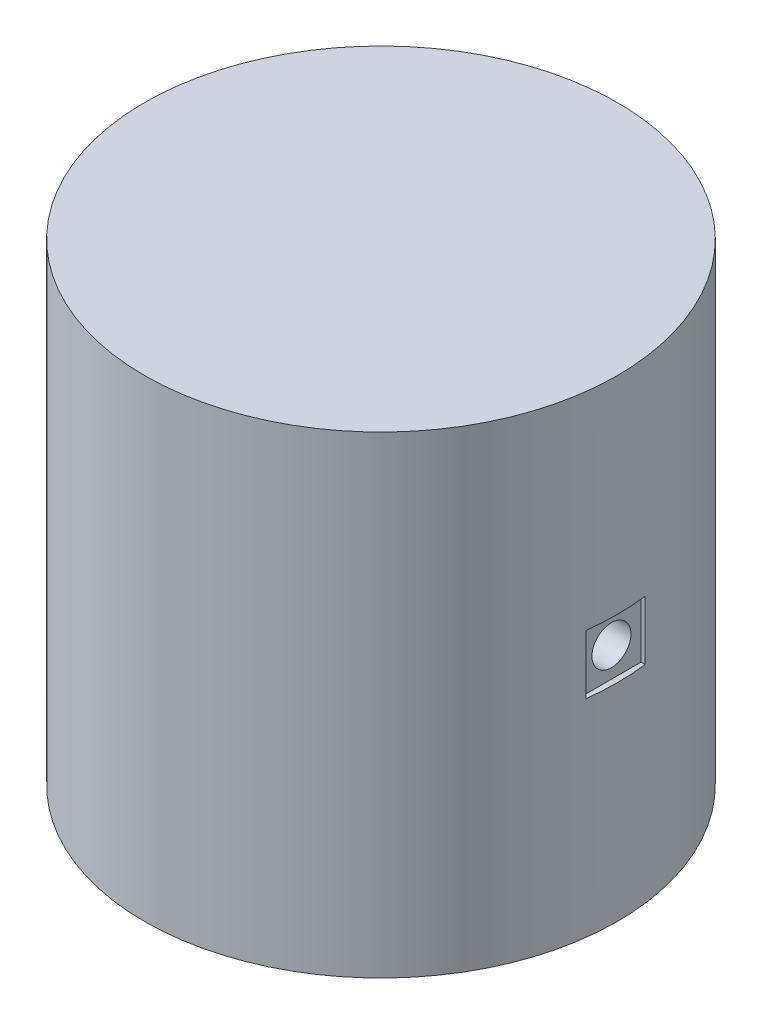
ISO-10303-21;
HEADER;
FILE_DESCRIPTION(('STEP AP214'),'2;1');
FILE_NAME('part.step','',(''),(''),'','','');
FILE_SCHEMA(('AUTOMOTIVE_DESIGN { 1 0 10303 214 1 1 1 1 }'));
ENDSEC;
DATA;
#1=APPLICATION_CONTEXT('core data for automotive mechanical design processes');
#2=APPLICATION_PROTOCOL_DEFINITION('international standard','automotive_design',2000,#1);
#3=PRODUCT_CONTEXT('',#1,'mechanical');
#4=PRODUCT('Part','Part','',(#3));
#5=PRODUCT_RELATED_PRODUCT_CATEGORY('part','',(#4));
#6=PRODUCT_DEFINITION_FORMATION('','',#4);
#7=PRODUCT_DEFINITION_CONTEXT('part definition',#1,'design');
#8=PRODUCT_DEFINITION('design','',#6,#7);
#9=PRODUCT_DEFINITION_SHAPE('','',#8);
#10=(LENGTH_UNIT() NAMED_UNIT(*) SI_UNIT(.MILLI.,.METRE.));
#11=(NAMED_UNIT(*) PLANE_ANGLE_UNIT() SI_UNIT($,.RADIAN.));
#12=(NAMED_UNIT(*) SI_UNIT($,.STERADIAN.) SOLID_ANGLE_UNIT());
#13=UNCERTAINTY_MEASURE_WITH_UNIT(LENGTH_MEASURE(1.E-05),#10,'distance_accuracy_value','');
#14=(GEOMETRIC_REPRESENTATION_CONTEXT(3) GLOBAL_UNCERTAINTY_ASSIGNED_CONTEXT((#13)) GLOBAL_UNIT_ASSIGNED_CONTEXT((#10,
#11,#12)) REPRESENTATION_CONTEXT('',''));
#15=CARTESIAN_POINT('',(0.,0.,0.));
#16=DIRECTION('',(0.,0.,1.));
#17=DIRECTION('',(1.,0.,0.));
#18=AXIS2_PLACEMENT_3D('',#15,#16,#17);
#19=CARTESIAN_POINT('',(0.,40.,0.));
#20=DIRECTION('',(0.,-1.,0.));
#21=DIRECTION('',(0.,0.,-1.));
#22=AXIS2_PLACEMENT_3D('',#19,#20,#21);
#23=CYLINDRICAL_SURFACE('',#22,20.);
#24=DIRECTION('',(0.,-1.,0.));
#25=VECTOR('',#24,1.);
#26=CARTESIAN_POINT('',(19.8431348329844,40.,-2.5));
#27=LINE('',#26,#25);
#28=CARTESIAN_POINT('',(19.8431348329844,22.5,-2.5));
#29=VERTEX_POINT('',#28);
#30=CARTESIAN_POINT('',(19.8431348329844,17.5,-2.5));
#31=VERTEX_POINT('',#30);
#32=EDGE_CURVE('E11',#29,#31,#27,.T.);
#33=ORIENTED_EDGE('',*,*,#32,.T.);
#34=CARTESIAN_POINT('',(0.,17.5,0.));
#35=DIRECTION('',(0.,-1.,0.));
#36=DIRECTION('',(0.,0.,-1.));
#37=AXIS2_PLACEMENT_3D('',#34,#35,#36);
#38=CIRCLE('',#37,20.);
#39=CARTESIAN_POINT('',(19.8431348329844,17.5,2.5));
#40=VERTEX_POINT('',#39);
#41=EDGE_CURVE('E59',#31,#40,#38,.T.);
#42=ORIENTED_EDGE('',*,*,#41,.T.);
#43=DIRECTION('',(0.,-1.,0.));
#44=VECTOR('',#43,1.);
#45=CARTESIAN_POINT('',(19.8431348329844,40.,2.5));
#46=LINE('',#45,#44);
#47=CARTESIAN_POINT('',(19.8431348329844,22.5,2.5));
#48=VERTEX_POINT('',#47);
#49=EDGE_CURVE('E251',#40,#48,#46,.F.);
#50=ORIENTED_EDGE('',*,*,#49,.T.);
#51=CARTESIAN_POINT('',(0.,22.5,0.));
#52=DIRECTION('',(0.,1.,0.));
#53=DIRECTION('',(0.,0.,1.));
#54=AXIS2_PLACEMENT_3D('',#51,#52,#53);
#55=CIRCLE('',#54,20.);
#56=EDGE_CURVE('E46',#48,#29,#55,.T.);
#57=ORIENTED_EDGE('',*,*,#56,.T.);
#58=EDGE_LOOP('',(#33,#42,#50,#57));
#59=FACE_BOUND('',#58,.T.);
#60=CARTESIAN_POINT('',(0.,24.,-20.));
#61=CARTESIAN_POINT('',(-0.222307627170533,23.9999918220066,-19.9999959032348));
#62=CARTESIAN_POINT('',(-0.444718640806089,23.9814046281294,-19.9962554071292));
#63=CARTESIAN_POINT('',(-0.883254030756077,23.907605999539,-19.9816946249293));
#64=CARTESIAN_POINT('',(-1.09937327016542,23.852365468794,-19.9708687144076));
#65=CARTESIAN_POINT('',(-1.51892122105325,23.7070349055168,-19.9433459711314));
#66=CARTESIAN_POINT('',(-1.72236187173253,23.6169782526213,-19.9266547630683));
#67=CARTESIAN_POINT('',(-2.1112319554569,23.4046710099548,-19.889215921413));
#68=CARTESIAN_POINT('',(-2.29666246030325,23.2824223375711,-19.8684685294298));
#69=CARTESIAN_POINT('',(-2.64677390925945,23.0074460228343,-19.8248866131972));
#70=CARTESIAN_POINT('',(-2.81117580463408,22.8543665784353,-19.8020298201681));
#71=CARTESIAN_POINT('',(-3.11214702643213,22.5228303344331,-19.7569672181094));
#72=CARTESIAN_POINT('',(-3.24871417908175,22.344371554659,-19.7347614600387));
#73=CARTESIAN_POINT('',(-3.49132701339042,21.965135227953,-19.6932976724827));
#74=CARTESIAN_POINT('',(-3.59708375546325,21.7641694248164,-19.6740682945156));
#75=CARTESIAN_POINT('',(-3.77322266632145,21.3468727239819,-19.6410507224189));
#76=CARTESIAN_POINT('',(-3.84360832974976,21.1305433466079,-19.6272619907853));
#77=CARTESIAN_POINT('',(-3.94610119953993,20.6916625443689,-19.6069122097851));
#78=CARTESIAN_POINT('',(-3.97869799183396,20.4692298234434,-19.6002588031638));
#79=CARTESIAN_POINT('',(-4.00620851090316,20.0219607145582,-19.5946550013038));
#80=CARTESIAN_POINT('',(-4.00112609085425,19.7971245747265,-19.5957038184152));
#81=CARTESIAN_POINT('',(-3.9538182924077,19.3550128479153,-19.6053020462212));
#82=CARTESIAN_POINT('',(-3.91215416097573,19.1376743774906,-19.6137381144293));
#83=CARTESIAN_POINT('',(-3.79375153849209,18.7131356933482,-19.6369818463213));
#84=CARTESIAN_POINT('',(-3.71701137240269,18.505935964324,-19.65178981429));
#85=CARTESIAN_POINT('',(-3.53009913469891,18.1059389531856,-19.6862247400376));
#86=CARTESIAN_POINT('',(-3.41970460492847,17.9132484817233,-19.7058835925539));
#87=CARTESIAN_POINT('',(-3.16877429829071,17.5489166001088,-19.7477847509168));
#88=CARTESIAN_POINT('',(-3.02823505742732,17.3772776125954,-19.7700273535331));
#89=CARTESIAN_POINT('',(-2.71799973824234,17.0566823901723,-19.81508084966));
#90=CARTESIAN_POINT('',(-2.54782464484978,16.9081897285635,-19.8378947684366));
#91=CARTESIAN_POINT('',(-2.18474009624804,16.6417846147951,-19.8811539485759));
#92=CARTESIAN_POINT('',(-1.99183034951756,16.5238725548257,-19.9015991795588));
#93=CARTESIAN_POINT('',(-1.58823754751569,16.3218899630961,-19.9378676064356));
#94=CARTESIAN_POINT('',(-1.3775272783412,16.2378724254219,-19.9536835539309));
#95=CARTESIAN_POINT('',(-0.944595905794662,16.1065581038457,-19.9788563595143));
#96=CARTESIAN_POINT('',(-0.722376200289802,16.0592568717055,-19.9882140000212));
#97=CARTESIAN_POINT('',(-0.276717622508605,16.0033741848229,-19.9993068746747));
#98=CARTESIAN_POINT('',(-0.053361313302308,15.9941583218389,-20.0011669860988));
#99=CARTESIAN_POINT('',(0.391699736770853,16.0129994357687,-19.9974020772041));
#100=CARTESIAN_POINT('',(0.61340456977517,16.0410543174104,-19.9917774776578));
#101=CARTESIAN_POINT('',(1.04682263978616,16.1331134941758,-19.9737532803207));
#102=CARTESIAN_POINT('',(1.25860779335961,16.1967922739916,-19.9614150561683));
#103=CARTESIAN_POINT('',(1.66849450999867,16.3579359306232,-19.9313420824413));
#104=CARTESIAN_POINT('',(1.86659504655016,16.4554033387073,-19.9136069285691));
#105=CARTESIAN_POINT('',(2.24616469474487,16.6827299626053,-19.8743964613318));
#106=CARTESIAN_POINT('',(2.42740050700875,16.8129711241558,-19.8528780174821));
#107=CARTESIAN_POINT('',(2.76567207647682,17.1016367648291,-19.8085893931953));
#108=CARTESIAN_POINT('',(2.92270523572305,17.2600642655995,-19.7858190787355));
#109=CARTESIAN_POINT('',(3.2105623630967,17.6034934075645,-19.7411721422786));
#110=CARTESIAN_POINT('',(3.34095080979462,17.7888629768853,-19.7193144093322));
#111=CARTESIAN_POINT('',(3.56874168020482,18.1792454454267,-19.6793676718478));
#112=CARTESIAN_POINT('',(3.66614542369161,18.3842575582942,-19.6612785165337));
#113=CARTESIAN_POINT('',(3.82460736632784,18.8070729845982,-19.6310696233753));
#114=CARTESIAN_POINT('',(3.8858539991642,19.0248033648413,-19.6189189948875));
#115=CARTESIAN_POINT('',(3.97083460650878,19.4677338139636,-19.601897471681));
#116=CARTESIAN_POINT('',(3.99457347290045,19.6929329048374,-19.5970256276445));
#117=CARTESIAN_POINT('',(4.00368364346987,20.1400354581773,-19.5951659852552));
#118=CARTESIAN_POINT('',(3.98974315228358,20.361924595708,-19.598036767572));
#119=CARTESIAN_POINT('',(3.92540921640024,20.8001265996201,-19.6110229393846));
#120=CARTESIAN_POINT('',(3.87501606451719,21.0164395107792,-19.6211382706868));
#121=CARTESIAN_POINT('',(3.73951427399582,21.4369108449622,-19.6474105687663));
#122=CARTESIAN_POINT('',(3.65449002686938,21.6410974420097,-19.6635528407532));
#123=CARTESIAN_POINT('',(3.45221857840642,22.0324148829378,-19.7000685989668));
#124=CARTESIAN_POINT('',(3.33496867509953,22.2195442949005,-19.7204424399558));
#125=CARTESIAN_POINT('',(3.06922365914566,22.5748622886013,-19.763558420929));
#126=CARTESIAN_POINT('',(2.92023154894072,22.7426750610704,-19.786334916388));
#127=CARTESIAN_POINT('',(2.59625747605256,23.0511448221167,-19.8314432748782));
#128=CARTESIAN_POINT('',(2.42126954861334,23.1917955612691,-19.8537750345274));
#129=CARTESIAN_POINT('',(2.04807051635299,23.4433385757858,-19.8957532955189));
#130=CARTESIAN_POINT('',(1.84963553771934,23.5539040131201,-19.9153692487698));
#131=CARTESIAN_POINT('',(1.43666544376293,23.7399444903864,-19.9494050034));
#132=CARTESIAN_POINT('',(1.22214504345251,23.81545115813,-19.9638294855446));
#133=CARTESIAN_POINT('',(0.839285955695119,23.9146077921789,-19.9830549038148));
#134=CARTESIAN_POINT('',(0.67312665605514,23.946572774831,-19.9893721263381));
#135=CARTESIAN_POINT('',(0.337998100840269,23.9892716494335,-19.9978461655957));
#136=CARTESIAN_POINT('',(0.169028934994477,24.0000062180391,-20.0000031149262));
#137=CARTESIAN_POINT('',(0.,24.,-20.));
#138=B_SPLINE_CURVE_WITH_KNOTS('',3,(#60,#61,#62,#63,#64,#65,#66,#67,#68,#69,#70,#71,#72,#73,
#74,#75,#76,#77,#78,#79,#80,#81,#82,#83,#84,#85,#86,#87,#88,#89,#90,#91,#92,#93,#94,#95,#96,#97,
#98,#99,#100,#101,#102,#103,#104,#105,#106,#107,#108,#109,#110,#111,#112,#113,#114,#115,#116,
#117,#118,#119,#120,#121,#122,#123,#124,#125,#126,#127,#128,#129,#130,#131,#132,#133,#134,#135,
#136,#137),.UNSPECIFIED.,.T.,.F.,(4,2,2,2,2,2,2,2,2,2,2,2,2,2,2,2,2,2,2,2,2,2,2,2,2,2,2,2,2,2,2,
2,2,2,2,2,2,2,4),(0.,0.666304522645033,1.33313860276529,1.99933494100137,2.66549160892345,
3.33973068044874,4.01402238698946,4.69444780023691,5.3748059746079,6.04624740416218,
6.71762017128681,7.37886908028893,8.04014957018699,8.70589960818151,9.37172619002462,
10.0495300996918,10.7273427016306,11.4062109941988,12.0849970279592,12.7524294270884,
13.4198243063525,14.0812181580667,14.7426615686787,15.4122026413721,16.081815533875,
16.7616251432068,17.4414075489765,18.1176152413467,18.7937347332544,19.4575889027459,
20.1214377397421,20.7836784501622,21.4459747033125,22.1195230496035,22.793226181355,
23.4739798670633,24.1541182207385,24.6607510116336,25.1673676548776),.UNSPECIFIED.);
#139=CARTESIAN_POINT('',(0.,24.,-20.));
#140=VERTEX_POINT('',#139);
#141=EDGE_CURVE('E155',#140,#140,#138,.T.);
#142=ORIENTED_EDGE('',*,*,#141,.T.);
#143=EDGE_LOOP('',(#142));
#144=FACE_BOUND('',#143,.T.);
#145=CARTESIAN_POINT('',(0.,40.,0.));
#146=DIRECTION('',(0.,1.,0.));
#147=DIRECTION('',(0.,0.,1.));
#148=AXIS2_PLACEMENT_3D('',#145,#146,#147);
#149=CIRCLE('',#148,20.);
#150=CARTESIAN_POINT('',(0.,40.,20.));
#151=VERTEX_POINT('',#150);
#152=EDGE_CURVE('E159',#151,#151,#149,.T.);
#153=ORIENTED_EDGE('',*,*,#152,.F.);
#154=EDGE_LOOP('',(#153));
#155=FACE_BOUND('',#154,.T.);
#156=CARTESIAN_POINT('',(0.,0.,0.));
#157=DIRECTION('',(0.,1.,0.));
#158=DIRECTION('',(0.,0.,1.));
#159=AXIS2_PLACEMENT_3D('',#156,#157,#158);
#160=CIRCLE('',#159,20.);
#161=CARTESIAN_POINT('',(0.,0.,20.));
#162=VERTEX_POINT('',#161);
#163=EDGE_CURVE('E162',#162,#162,#160,.T.);
#164=ORIENTED_EDGE('',*,*,#163,.T.);
#165=EDGE_LOOP('',(#164));
#166=FACE_BOUND('',#165,.T.);
#167=ADVANCED_FACE('F38',(#59,#144,#155,#166),#23,.T.);
#168=CARTESIAN_POINT('',(0.,40.,0.));
#169=DIRECTION('',(0.,1.,0.));
#170=DIRECTION('',(0.,0.,1.));
#171=AXIS2_PLACEMENT_3D('',#168,#169,#170);
#172=PLANE('',#171);
#173=ORIENTED_EDGE('',*,*,#152,.T.);
#174=EDGE_LOOP('',(#173));
#175=FACE_BOUND('',#174,.T.);
#176=ADVANCED_FACE('F144',(#175),#172,.T.);
#177=CARTESIAN_POINT('',(0.,0.,0.));
#178=DIRECTION('',(0.,1.,0.));
#179=DIRECTION('',(0.,0.,1.));
#180=AXIS2_PLACEMENT_3D('',#177,#178,#179);
#181=PLANE('',#180);
#182=ORIENTED_EDGE('',*,*,#163,.F.);
#183=EDGE_LOOP('',(#182));
#184=FACE_BOUND('',#183,.T.);
#185=ADVANCED_FACE('F148',(#184),#181,.F.);
#186=CARTESIAN_POINT('',(0.,20.,10.));
#187=DIRECTION('',(0.,0.,-1.));
#188=DIRECTION('',(-1.,0.,0.));
#189=AXIS2_PLACEMENT_3D('',#186,#187,#188);
#190=CYLINDRICAL_SURFACE('',#189,4.);
#191=CARTESIAN_POINT('',(4.,20.,-1.65));
#192=CARTESIAN_POINT('',(3.99999309817074,20.0884596783633,-1.64999078279336));
#193=CARTESIAN_POINT('',(3.99703145792172,20.1770622520576,-1.64284398565668));
#194=CARTESIAN_POINT('',(3.9854711320255,20.3517596698364,-1.6145088580631));
#195=CARTESIAN_POINT('',(3.97685757767606,20.437847271997,-1.59328348897568));
#196=CARTESIAN_POINT('',(3.95491965529936,20.6047024969027,-1.5377051877981));
#197=CARTESIAN_POINT('',(3.94161112398211,20.6854869344912,-1.50339635664654));
#198=CARTESIAN_POINT('',(3.91158286286531,20.8400766332235,-1.42280524215057));
#199=CARTESIAN_POINT('',(3.89486420463244,20.9138840761176,-1.37652671882984));
#200=CARTESIAN_POINT('',(3.85876900012149,21.0561876959853,-1.27089324535595));
#201=CARTESIAN_POINT('',(3.83930654387258,21.1242937395748,-1.21104232975102));
#202=CARTESIAN_POINT('',(3.80029483347099,21.2498357438476,-1.08101116034103));
#203=CARTESIAN_POINT('',(3.78074553976622,21.3072661892696,-1.01082560078819));
#204=CARTESIAN_POINT('',(3.74272551686067,21.4125482680905,-0.858031751128285));
#205=CARTESIAN_POINT('',(3.72435159658093,21.4598078179056,-0.774988884693473));
#206=CARTESIAN_POINT('',(3.69212136090386,21.5395135819941,-0.601263690709815));
#207=CARTESIAN_POINT('',(3.67826276509115,21.5719672771279,-0.510585248636989));
#208=CARTESIAN_POINT('',(3.65756021871623,21.6195373822249,-0.328652002998168));
#209=CARTESIAN_POINT('',(3.65041449103236,21.6354037141715,-0.237628927856928));
#210=CARTESIAN_POINT('',(3.64307714795703,21.651689181208,-0.0539534926347211));
#211=CARTESIAN_POINT('',(3.64288180572738,21.65211659474,0.0386979676293037));
#212=CARTESIAN_POINT('',(3.64921138579605,21.6380778077983,0.215598886618723));
#213=CARTESIAN_POINT('',(3.6552343974104,21.6247239848746,0.299958158749157));
#214=CARTESIAN_POINT('',(3.67247532251837,21.585364842312,0.465110284381171));
#215=CARTESIAN_POINT('',(3.68369420783859,21.5593571558718,0.545902467603298));
#216=CARTESIAN_POINT('',(3.71031458481431,21.4949241294249,0.703645108758621));
#217=CARTESIAN_POINT('',(3.72579923184191,21.4562486697302,0.78047873780833));
#218=CARTESIAN_POINT('',(3.75918616236907,21.3677544544362,0.926860232460034));
#219=CARTESIAN_POINT('',(3.77708938726885,21.3179313547816,0.996405242249149));
#220=CARTESIAN_POINT('',(3.81509742396095,21.2037191192487,1.13228640778781));
#221=CARTESIAN_POINT('',(3.8352618825369,21.1384663009439,1.19788195770326));
#222=CARTESIAN_POINT('',(3.87426910607353,20.9976825548662,1.31744467444138));
#223=CARTESIAN_POINT('',(3.8931115728953,20.9221493198474,1.37140922386084));
#224=CARTESIAN_POINT('',(3.92787932271737,20.7607363697373,1.46723477358504));
#225=CARTESIAN_POINT('',(3.94373050716791,20.6746640940722,1.50880028319417));
#226=CARTESIAN_POINT('',(3.97016319816605,20.495928253553,1.57660302410888));
#227=CARTESIAN_POINT('',(3.98074755693754,20.4032682873724,1.60284855321117));
#228=CARTESIAN_POINT('',(3.99492450637935,20.2201813043177,1.63772950367822));
#229=CARTESIAN_POINT('',(3.99891121146315,20.1299741723082,1.64735917793593));
#230=CARTESIAN_POINT('',(4.00069746426785,19.9491525598478,1.6516920437633));
#231=CARTESIAN_POINT('',(3.99849874371343,19.8585382004994,1.64639941310822));
#232=CARTESIAN_POINT('',(3.98841747083847,19.6840922445124,1.62175473175704));
#233=CARTESIAN_POINT('',(3.9808153168881,19.6001446824733,1.60309592665991));
#234=CARTESIAN_POINT('',(3.96098887803091,19.4366595266704,1.55320790366289));
#235=CARTESIAN_POINT('',(3.94876400644332,19.3571224941279,1.52197709018521));
#236=CARTESIAN_POINT('',(3.92039728883464,19.2019380240355,1.44681062001911));
#237=CARTESIAN_POINT('',(3.90414585630856,19.1264873433395,1.40251143824378));
#238=CARTESIAN_POINT('',(3.86946768187548,18.9838215267909,1.30286606574213));
#239=CARTESIAN_POINT('',(3.85104004134398,18.9166098165789,1.24751530491016));
#240=CARTESIAN_POINT('',(3.8124029584454,18.7873800570726,1.12279569518803));
#241=CARTESIAN_POINT('',(3.79215916493832,18.7260563543818,1.0527161759607));
#242=CARTESIAN_POINT('',(3.7533392894083,18.6158516451749,0.902928709391473));
#243=CARTESIAN_POINT('',(3.73476355904109,18.5669732583727,0.823218740057447));
#244=CARTESIAN_POINT('',(3.70128700339843,18.4825771770861,0.654904629466687));
#245=CARTESIAN_POINT('',(3.68643724424496,18.4472419706347,0.566198083991944));
#246=CARTESIAN_POINT('',(3.66281640168181,18.3923038183461,0.383290834021757));
#247=CARTESIAN_POINT('',(3.65404044124936,18.3726882482525,0.289094603581828));
#248=CARTESIAN_POINT('',(3.64429559365239,18.3509887605973,0.105569726841936));
#249=CARTESIAN_POINT('',(3.64278573581523,18.3476895063588,0.0164127805420622));
#250=CARTESIAN_POINT('',(3.64631178238903,18.3554851464343,-0.161128470759178));
#251=CARTESIAN_POINT('',(3.65134672892697,18.3665779343827,-0.24951288691937));
#252=CARTESIAN_POINT('',(3.666904904187,18.4018288199343,-0.418933071257696));
#253=CARTESIAN_POINT('',(3.67717261200251,18.4253804156255,-0.500120711422108));
#254=CARTESIAN_POINT('',(3.70184411206584,18.4842940052707,-0.657414522474082));
#255=CARTESIAN_POINT('',(3.7162490615217,18.5196593040311,-0.733519264297608));
#256=CARTESIAN_POINT('',(3.7486340889516,18.6036193774621,-0.883422038241396));
#257=CARTESIAN_POINT('',(3.76677577854003,18.6528755640073,-0.956814071021407));
#258=CARTESIAN_POINT('',(3.80412864636709,18.7622828186218,-1.09467168726428));
#259=CARTESIAN_POINT('',(3.82334018195056,18.8224375422704,-1.15913426277442));
#260=CARTESIAN_POINT('',(3.86230172013188,18.9569926124426,-1.28199413870367));
#261=CARTESIAN_POINT('',(3.88199359359226,19.0320998892698,-1.33963922360553));
#262=CARTESIAN_POINT('',(3.91832426905579,19.191656536818,-1.44154015953871));
#263=CARTESIAN_POINT('',(3.9349616732268,19.2761101565571,-1.48578988636589));
#264=CARTESIAN_POINT('',(3.96305691394126,19.4505852398904,-1.55866373983474));
#265=CARTESIAN_POINT('',(3.97459855421812,19.5404866183506,-1.58754242535854));
#266=CARTESIAN_POINT('',(3.99154438775475,19.7242807707868,-1.62951108478514));
#267=CARTESIAN_POINT('',(3.99696786149576,19.818160033182,-1.64265066624544));
#268=CARTESIAN_POINT('',(3.99968194626838,19.9415557047728,-1.64922677033004));
#269=CARTESIAN_POINT('',(4.00000228058838,19.9707700513297,-1.65000304566421));
#270=CARTESIAN_POINT('',(4.,20.,-1.65));
#271=B_SPLINE_CURVE_WITH_KNOTS('',3,(#191,#192,#193,#194,#195,#196,#197,#198,#199,#200,#201,
#202,#203,#204,#205,#206,#207,#208,#209,#210,#211,#212,#213,#214,#215,#216,#217,#218,#219,#220,
#221,#222,#223,#224,#225,#226,#227,#228,#229,#230,#231,#232,#233,#234,#235,#236,#237,#238,#239,
#240,#241,#242,#243,#244,#245,#246,#247,#248,#249,#250,#251,#252,#253,#254,#255,#256,#257,#258,
#259,#260,#261,#262,#263,#264,#265,#266,#267,#268,#269,#270),.UNSPECIFIED.,.T.,.F.,(4,2,2,2,2,2,
2,2,2,2,2,2,2,2,2,2,2,2,2,2,2,2,2,2,2,2,2,2,2,2,2,2,2,2,2,2,2,2,2,4),(0.,0.265297098770622,
0.53129493790666,0.796403981498878,1.06142984766523,1.33841878994457,1.61555043582129,
1.90598404924538,2.19627075414925,2.47277648539421,2.7491339503796,3.00480633611683,
3.2605265616686,3.52163539301341,3.78284615202014,4.06565185095456,4.34852112528509,
4.63767392136375,4.92666995726767,5.19768149557685,5.46861716672805,5.72643264660554,
5.98428085748384,6.25011488704506,6.51605907418432,6.80064580250402,7.08529238632158,
7.37364985225781,7.66177550895676,7.92807823226724,8.19434198489785,8.44869772098559,
8.70312467109945,8.97267479984709,9.24231550885213,9.53104085816542,9.81989801073178,
10.1038095613048,10.3868238858899,10.4744866574818),.UNSPECIFIED.);
#272=CARTESIAN_POINT('',(4.,20.,-1.65));
#273=VERTEX_POINT('',#272);
#274=EDGE_CURVE('E111',#273,#273,#271,.T.);
#275=ORIENTED_EDGE('',*,*,#274,.T.);
#276=EDGE_LOOP('',(#275));
#277=FACE_BOUND('',#276,.T.);
#278=CARTESIAN_POINT('',(0.,20.,10.));
#279=DIRECTION('',(0.,0.,-1.));
#280=DIRECTION('',(-1.,0.,0.));
#281=AXIS2_PLACEMENT_3D('',#278,#279,#280);
#282=CIRCLE('',#281,4.);
#283=CARTESIAN_POINT('',(-4.,20.,10.));
#284=VERTEX_POINT('',#283);
#285=EDGE_CURVE('E119',#284,#284,#282,.T.);
#286=ORIENTED_EDGE('',*,*,#285,.F.);
#287=EDGE_LOOP('',(#286));
#288=FACE_BOUND('',#287,.T.);
#289=ORIENTED_EDGE('',*,*,#141,.F.);
#290=EDGE_LOOP('',(#289));
#291=FACE_BOUND('',#290,.T.);
#292=ADVANCED_FACE('F173',(#277,#288,#291),#190,.F.);
#293=CARTESIAN_POINT('',(0.,20.,10.));
#294=DIRECTION('',(0.,0.,-1.));
#295=DIRECTION('',(-1.,0.,0.));
#296=AXIS2_PLACEMENT_3D('',#293,#294,#295);
#297=PLANE('',#296);
#298=ORIENTED_EDGE('',*,*,#285,.T.);
#299=EDGE_LOOP('',(#298));
#300=FACE_BOUND('',#299,.T.);
#301=ADVANCED_FACE('F127',(#300),#297,.T.);
#302=CARTESIAN_POINT('',(20.,20.,0.));
#303=DIRECTION('',(1.,0.,0.));
#304=DIRECTION('',(0.,0.,-1.));
#305=AXIS2_PLACEMENT_3D('',#302,#303,#304);
#306=CYLINDRICAL_SURFACE('',#305,1.65);
#307=CARTESIAN_POINT('',(19.5,20.,0.));
#308=DIRECTION('',(-1.,0.,0.));
#309=DIRECTION('',(0.,0.,1.));
#310=AXIS2_PLACEMENT_3D('',#307,#308,#309);
#311=CIRCLE('',#310,1.65);
#312=CARTESIAN_POINT('',(19.5,20.,1.65));
#313=VERTEX_POINT('',#312);
#314=EDGE_CURVE('E107',#313,#313,#311,.F.);
#315=ORIENTED_EDGE('',*,*,#314,.T.);
#316=EDGE_LOOP('',(#315));
#317=FACE_BOUND('',#316,.T.);
#318=ORIENTED_EDGE('',*,*,#274,.F.);
#319=EDGE_LOOP('',(#318));
#320=FACE_BOUND('',#319,.T.);
#321=ADVANCED_FACE('F123',(#317,#320),#306,.F.);
#322=CARTESIAN_POINT('',(19.5,17.5,-2.5));
#323=DIRECTION('',(0.,0.,-1.));
#324=DIRECTION('',(-1.,0.,0.));
#325=AXIS2_PLACEMENT_3D('',#322,#323,#324);
#326=PLANE('',#325);
#327=DIRECTION('',(1.,0.,0.));
#328=VECTOR('',#327,1.);
#329=CARTESIAN_POINT('',(19.5,22.5,-2.5));
#330=LINE('',#329,#328);
#331=CARTESIAN_POINT('',(19.5,22.5,-2.5));
#332=VERTEX_POINT('',#331);
#333=EDGE_CURVE('E79',#332,#29,#330,.T.);
#334=ORIENTED_EDGE('',*,*,#333,.F.);
#335=DIRECTION('',(0.,1.,0.));
#336=VECTOR('',#335,1.);
#337=CARTESIAN_POINT('',(19.5,17.5,-2.5));
#338=LINE('',#337,#336);
#339=CARTESIAN_POINT('',(19.5,17.5,-2.5));
#340=VERTEX_POINT('',#339);
#341=EDGE_CURVE('E83',#340,#332,#338,.T.);
#342=ORIENTED_EDGE('',*,*,#341,.F.);
#343=DIRECTION('',(1.,0.,0.));
#344=VECTOR('',#343,1.);
#345=CARTESIAN_POINT('',(19.5,17.5,-2.5));
#346=LINE('',#345,#344);
#347=EDGE_CURVE('E105',#340,#31,#346,.T.);
#348=ORIENTED_EDGE('',*,*,#347,.T.);
#349=ORIENTED_EDGE('',*,*,#32,.F.);
#350=EDGE_LOOP('',(#334,#342,#348,#349));
#351=FACE_BOUND('',#350,.T.);
#352=ADVANCED_FACE('F81',(#351),#326,.F.);
#353=CARTESIAN_POINT('',(19.5,17.5,2.5));
#354=DIRECTION('',(0.,-1.,0.));
#355=DIRECTION('',(0.,0.,-1.));
#356=AXIS2_PLACEMENT_3D('',#353,#354,#355);
#357=PLANE('',#356);
#358=ORIENTED_EDGE('',*,*,#347,.F.);
#359=DIRECTION('',(0.,0.,-1.));
#360=VECTOR('',#359,1.);
#361=CARTESIAN_POINT('',(19.5,17.5,2.5));
#362=LINE('',#361,#360);
#363=CARTESIAN_POINT('',(19.5,17.5,2.5));
#364=VERTEX_POINT('',#363);
#365=EDGE_CURVE('E87',#364,#340,#362,.T.);
#366=ORIENTED_EDGE('',*,*,#365,.F.);
#367=DIRECTION('',(1.,0.,0.));
#368=VECTOR('',#367,1.);
#369=CARTESIAN_POINT('',(19.5,17.5,2.5));
#370=LINE('',#369,#368);
#371=EDGE_CURVE('E108',#364,#40,#370,.T.);
#372=ORIENTED_EDGE('',*,*,#371,.T.);
#373=ORIENTED_EDGE('',*,*,#41,.F.);
#374=EDGE_LOOP('',(#358,#366,#372,#373));
#375=FACE_BOUND('',#374,.T.);
#376=ADVANCED_FACE('F131',(#375),#357,.F.);
#377=CARTESIAN_POINT('',(19.5,17.5,2.5));
#378=DIRECTION('',(0.,0.,1.));
#379=DIRECTION('',(1.,0.,0.));
#380=AXIS2_PLACEMENT_3D('',#377,#378,#379);
#381=PLANE('',#380);
#382=ORIENTED_EDGE('',*,*,#371,.F.);
#383=DIRECTION('',(0.,-1.,0.));
#384=VECTOR('',#383,1.);
#385=CARTESIAN_POINT('',(19.5,17.5,2.5));
#386=LINE('',#385,#384);
#387=CARTESIAN_POINT('',(19.5,22.5,2.5));
#388=VERTEX_POINT('',#387);
#389=EDGE_CURVE('E96',#388,#364,#386,.T.);
#390=ORIENTED_EDGE('',*,*,#389,.F.);
#391=DIRECTION('',(1.,0.,0.));
#392=VECTOR('',#391,1.);
#393=CARTESIAN_POINT('',(19.5,22.5,2.5));
#394=LINE('',#393,#392);
#395=EDGE_CURVE('E86',#388,#48,#394,.T.);
#396=ORIENTED_EDGE('',*,*,#395,.T.);
#397=ORIENTED_EDGE('',*,*,#49,.F.);
#398=EDGE_LOOP('',(#382,#390,#396,#397));
#399=FACE_BOUND('',#398,.T.);
#400=ADVANCED_FACE('F134',(#399),#381,.F.);
#401=CARTESIAN_POINT('',(19.5,22.5,2.5));
#402=DIRECTION('',(0.,1.,0.));
#403=DIRECTION('',(0.,0.,1.));
#404=AXIS2_PLACEMENT_3D('',#401,#402,#403);
#405=PLANE('',#404);
#406=ORIENTED_EDGE('',*,*,#395,.F.);
#407=DIRECTION('',(0.,0.,1.));
#408=VECTOR('',#407,1.);
#409=CARTESIAN_POINT('',(19.5,22.5,2.5));
#410=LINE('',#409,#408);
#411=EDGE_CURVE('E90',#332,#388,#410,.T.);
#412=ORIENTED_EDGE('',*,*,#411,.F.);
#413=ORIENTED_EDGE('',*,*,#333,.T.);
#414=ORIENTED_EDGE('',*,*,#56,.F.);
#415=EDGE_LOOP('',(#406,#412,#413,#414));
#416=FACE_BOUND('',#415,.T.);
#417=ADVANCED_FACE('F91',(#416),#405,.F.);
#418=CARTESIAN_POINT('',(19.5,0.,0.));
#419=DIRECTION('',(-1.,0.,0.));
#420=DIRECTION('',(0.,0.,1.));
#421=AXIS2_PLACEMENT_3D('',#418,#419,#420);
#422=PLANE('',#421);
#423=ORIENTED_EDGE('',*,*,#341,.T.);
#424=ORIENTED_EDGE('',*,*,#411,.T.);
#425=ORIENTED_EDGE('',*,*,#389,.T.);
#426=ORIENTED_EDGE('',*,*,#365,.T.);
#427=EDGE_LOOP('',(#423,#424,#425,#426));
#428=FACE_BOUND('',#427,.T.);
#429=ORIENTED_EDGE('',*,*,#314,.F.);
#430=EDGE_LOOP('',(#429));
#431=FACE_BOUND('',#430,.T.);
#432=ADVANCED_FACE('F98',(#428,#431),#422,.F.);
#433=CLOSED_SHELL('',(#167,#176,#185,#292,#301,#321,#352,#376,#400,#417,#432));
#434=MANIFOLD_SOLID_BREP('B2',#433);
#435=ADVANCED_BREP_SHAPE_REPRESENTATION('',(#18,#434),#14);
#436=SHAPE_DEFINITION_REPRESENTATION(#9,#435);
ENDSEC;
END-ISO-10303-21;
